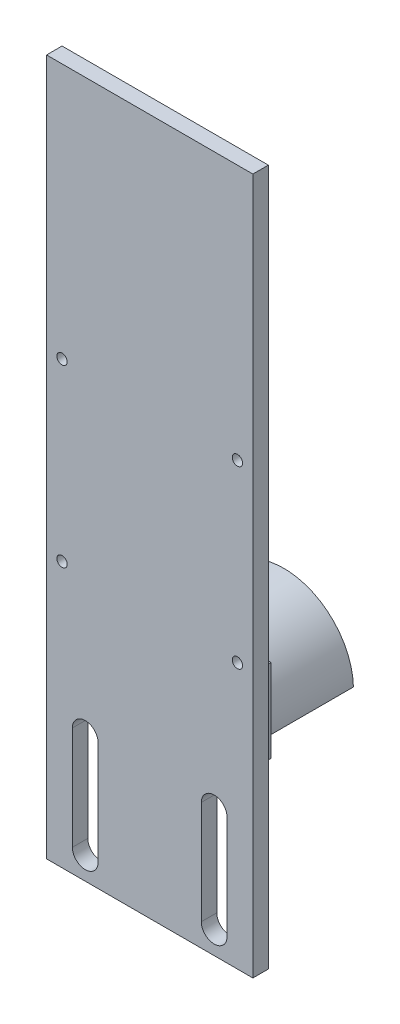
ISO-10303-21;
HEADER;
FILE_DESCRIPTION(('STEP AP214'),'2;1');
FILE_NAME('part.step','',(''),(''),'','','');
FILE_SCHEMA(('AUTOMOTIVE_DESIGN { 1 0 10303 214 1 1 1 1 }'));
ENDSEC;
DATA;
#1=APPLICATION_CONTEXT('core data for automotive mechanical design processes');
#2=APPLICATION_PROTOCOL_DEFINITION('international standard','automotive_design',2000,#1);
#3=PRODUCT_CONTEXT('',#1,'mechanical');
#4=PRODUCT('Part','Part','',(#3));
#5=PRODUCT_RELATED_PRODUCT_CATEGORY('part','',(#4));
#6=PRODUCT_DEFINITION_FORMATION('','',#4);
#7=PRODUCT_DEFINITION_CONTEXT('part definition',#1,'design');
#8=PRODUCT_DEFINITION('design','',#6,#7);
#9=PRODUCT_DEFINITION_SHAPE('','',#8);
#10=(LENGTH_UNIT() NAMED_UNIT(*) SI_UNIT(.MILLI.,.METRE.));
#11=(NAMED_UNIT(*) PLANE_ANGLE_UNIT() SI_UNIT($,.RADIAN.));
#12=(NAMED_UNIT(*) SI_UNIT($,.STERADIAN.) SOLID_ANGLE_UNIT());
#13=UNCERTAINTY_MEASURE_WITH_UNIT(LENGTH_MEASURE(1.E-05),#10,'distance_accuracy_value','');
#14=(GEOMETRIC_REPRESENTATION_CONTEXT(3) GLOBAL_UNCERTAINTY_ASSIGNED_CONTEXT((#13)) GLOBAL_UNIT_ASSIGNED_CONTEXT((#10,
#11,#12)) REPRESENTATION_CONTEXT('',''));
#15=CARTESIAN_POINT('',(0.,0.,0.));
#16=DIRECTION('',(0.,0.,1.));
#17=DIRECTION('',(1.,0.,0.));
#18=AXIS2_PLACEMENT_3D('',#15,#16,#17);
#19=CARTESIAN_POINT('',(0.,0.,0.));
#20=DIRECTION('',(0.,0.,-1.));
#21=DIRECTION('',(-1.,0.,0.));
#22=AXIS2_PLACEMENT_3D('',#19,#20,#21);
#23=PLANE('',#22);
#24=CARTESIAN_POINT('',(32.5,-10.5508711398169,0.));
#25=DIRECTION('',(0.,0.,-1.));
#26=DIRECTION('',(-1.,0.,0.));
#27=AXIS2_PLACEMENT_3D('',#24,#25,#26);
#28=CIRCLE('',#27,2.5);
#29=CARTESIAN_POINT('',(35.,-10.5508711398169,0.));
#30=VERTEX_POINT('',#29);
#31=CARTESIAN_POINT('',(30.,-10.5508711398169,0.));
#32=VERTEX_POINT('',#31);
#33=EDGE_CURVE('E467',#30,#32,#28,.T.);
#34=ORIENTED_EDGE('',*,*,#33,.F.);
#35=DIRECTION('',(0.,1.,0.));
#36=VECTOR('',#35,1.);
#37=CARTESIAN_POINT('',(35.,0.,0.));
#38=LINE('',#37,#36);
#39=CARTESIAN_POINT('',(35.,9.48176586604178,0.));
#40=VERTEX_POINT('',#39);
#41=EDGE_CURVE('E463',#30,#40,#38,.T.);
#42=ORIENTED_EDGE('',*,*,#41,.T.);
#43=CARTESIAN_POINT('',(32.5,9.48176586604178,0.));
#44=DIRECTION('',(0.,0.,-1.));
#45=DIRECTION('',(-1.,0.,0.));
#46=AXIS2_PLACEMENT_3D('',#43,#44,#45);
#47=CIRCLE('',#46,2.5);
#48=CARTESIAN_POINT('',(30.,9.48176586604178,0.));
#49=VERTEX_POINT('',#48);
#50=EDGE_CURVE('E460',#49,#40,#47,.T.);
#51=ORIENTED_EDGE('',*,*,#50,.F.);
#52=DIRECTION('',(0.,1.,0.));
#53=VECTOR('',#52,1.);
#54=CARTESIAN_POINT('',(30.,0.,0.));
#55=LINE('',#54,#53);
#56=EDGE_CURVE('E436',#32,#49,#55,.T.);
#57=ORIENTED_EDGE('',*,*,#56,.F.);
#58=EDGE_LOOP('',(#34,#42,#51,#57));
#59=FACE_BOUND('',#58,.T.);
#60=DIRECTION('',(-1.,0.,0.));
#61=VECTOR('',#60,1.);
#62=CARTESIAN_POINT('',(0.,120.,0.));
#63=LINE('',#62,#61);
#64=CARTESIAN_POINT('',(40.,120.,0.));
#65=VERTEX_POINT('',#64);
#66=CARTESIAN_POINT('',(0.,120.,0.));
#67=VERTEX_POINT('',#66);
#68=EDGE_CURVE('E411',#65,#67,#63,.T.);
#69=ORIENTED_EDGE('',*,*,#68,.F.);
#70=DIRECTION('',(0.,1.,0.));
#71=VECTOR('',#70,1.);
#72=CARTESIAN_POINT('',(40.,0.,0.));
#73=LINE('',#72,#71);
#74=CARTESIAN_POINT('',(40.,-15.,0.));
#75=VERTEX_POINT('',#74);
#76=EDGE_CURVE('E420',#75,#65,#73,.T.);
#77=ORIENTED_EDGE('',*,*,#76,.F.);
#78=DIRECTION('',(1.,0.,0.));
#79=VECTOR('',#78,1.);
#80=CARTESIAN_POINT('',(0.,-15.,0.));
#81=LINE('',#80,#79);
#82=CARTESIAN_POINT('',(0.,-15.,0.));
#83=VERTEX_POINT('',#82);
#84=EDGE_CURVE('E360',#83,#75,#81,.T.);
#85=ORIENTED_EDGE('',*,*,#84,.F.);
#86=DIRECTION('',(0.,-1.,0.));
#87=VECTOR('',#86,1.);
#88=CARTESIAN_POINT('',(0.,0.,0.));
#89=LINE('',#88,#87);
#90=EDGE_CURVE('E406',#67,#83,#89,.T.);
#91=ORIENTED_EDGE('',*,*,#90,.F.);
#92=EDGE_LOOP('',(#69,#77,#85,#91));
#93=FACE_BOUND('',#92,.T.);
#94=CARTESIAN_POINT('',(3.,70.4461491386061,0.));
#95=DIRECTION('',(0.,0.,-1.));
#96=DIRECTION('',(-1.,0.,0.));
#97=AXIS2_PLACEMENT_3D('',#94,#95,#96);
#98=CIRCLE('',#97,1.);
#99=CARTESIAN_POINT('',(2.,70.4461491386061,0.));
#100=VERTEX_POINT('',#99);
#101=EDGE_CURVE('E402',#100,#100,#98,.F.);
#102=ORIENTED_EDGE('',*,*,#101,.T.);
#103=EDGE_LOOP('',(#102));
#104=FACE_BOUND('',#103,.T.);
#105=CARTESIAN_POINT('',(37.,36.4461491386061,0.));
#106=DIRECTION('',(0.,0.,-1.));
#107=DIRECTION('',(-1.,0.,0.));
#108=AXIS2_PLACEMENT_3D('',#105,#106,#107);
#109=CIRCLE('',#108,0.999999999999998);
#110=CARTESIAN_POINT('',(36.,36.4461491386061,0.));
#111=VERTEX_POINT('',#110);
#112=EDGE_CURVE('E378',#111,#111,#109,.F.);
#113=ORIENTED_EDGE('',*,*,#112,.T.);
#114=EDGE_LOOP('',(#113));
#115=FACE_BOUND('',#114,.T.);
#116=CARTESIAN_POINT('',(37.,70.4461491386061,0.));
#117=DIRECTION('',(0.,0.,-1.));
#118=DIRECTION('',(-1.,0.,0.));
#119=AXIS2_PLACEMENT_3D('',#116,#117,#118);
#120=CIRCLE('',#119,0.999999999999998);
#121=CARTESIAN_POINT('',(36.,70.4461491386061,0.));
#122=VERTEX_POINT('',#121);
#123=EDGE_CURVE('E388',#122,#122,#120,.F.);
#124=ORIENTED_EDGE('',*,*,#123,.T.);
#125=EDGE_LOOP('',(#124));
#126=FACE_BOUND('',#125,.T.);
#127=CARTESIAN_POINT('',(3.,36.4461491386061,0.));
#128=DIRECTION('',(0.,0.,-1.));
#129=DIRECTION('',(-1.,0.,0.));
#130=AXIS2_PLACEMENT_3D('',#127,#128,#129);
#131=CIRCLE('',#130,1.);
#132=CARTESIAN_POINT('',(2.,36.4461491386061,0.));
#133=VERTEX_POINT('',#132);
#134=EDGE_CURVE('E387',#133,#133,#131,.F.);
#135=ORIENTED_EDGE('',*,*,#134,.T.);
#136=EDGE_LOOP('',(#135));
#137=FACE_BOUND('',#136,.T.);
#138=DIRECTION('',(0.,1.,0.));
#139=VECTOR('',#138,1.);
#140=CARTESIAN_POINT('',(5.,0.,0.));
#141=LINE('',#140,#139);
#142=CARTESIAN_POINT('',(5.,-10.5508711398169,0.));
#143=VERTEX_POINT('',#142);
#144=CARTESIAN_POINT('',(5.,9.48176586604178,0.));
#145=VERTEX_POINT('',#144);
#146=EDGE_CURVE('E471',#143,#145,#141,.T.);
#147=ORIENTED_EDGE('',*,*,#146,.F.);
#148=CARTESIAN_POINT('',(7.5,-10.5508711398169,0.));
#149=DIRECTION('',(0.,0.,-1.));
#150=DIRECTION('',(-1.,0.,0.));
#151=AXIS2_PLACEMENT_3D('',#148,#149,#150);
#152=CIRCLE('',#151,2.5);
#153=CARTESIAN_POINT('',(10.,-10.5508711398169,0.));
#154=VERTEX_POINT('',#153);
#155=EDGE_CURVE('E482',#143,#154,#152,.F.);
#156=ORIENTED_EDGE('',*,*,#155,.T.);
#157=DIRECTION('',(0.,1.,0.));
#158=VECTOR('',#157,1.);
#159=CARTESIAN_POINT('',(10.,0.,0.));
#160=LINE('',#159,#158);
#161=CARTESIAN_POINT('',(10.,9.48176586604178,0.));
#162=VERTEX_POINT('',#161);
#163=EDGE_CURVE('E478',#154,#162,#160,.T.);
#164=ORIENTED_EDGE('',*,*,#163,.T.);
#165=CARTESIAN_POINT('',(7.5,9.48176586604178,0.));
#166=DIRECTION('',(0.,0.,-1.));
#167=DIRECTION('',(-1.,0.,0.));
#168=AXIS2_PLACEMENT_3D('',#165,#166,#167);
#169=CIRCLE('',#168,2.5);
#170=EDGE_CURVE('E474',#162,#145,#169,.F.);
#171=ORIENTED_EDGE('',*,*,#170,.T.);
#172=EDGE_LOOP('',(#147,#156,#164,#171));
#173=FACE_BOUND('',#172,.T.);
#174=DIRECTION('',(0.,-1.,0.));
#175=VECTOR('',#174,1.);
#176=CARTESIAN_POINT('',(1.50351433339008,17.6115071637248,0.));
#177=LINE('',#176,#175);
#178=CARTESIAN_POINT('',(1.50351433339008,18.6115071637248,0.));
#179=VERTEX_POINT('',#178);
#180=CARTESIAN_POINT('',(1.50351433339008,17.6115071637248,0.));
#181=VERTEX_POINT('',#180);
#182=EDGE_CURVE('E503',#179,#181,#177,.T.);
#183=ORIENTED_EDGE('',*,*,#182,.T.);
#184=DIRECTION('',(-1.,0.,0.));
#185=VECTOR('',#184,1.);
#186=CARTESIAN_POINT('',(40.01,17.6115071637248,0.));
#187=LINE('',#186,#185);
#188=CARTESIAN_POINT('',(37.5,17.6115071637248,0.));
#189=VERTEX_POINT('',#188);
#190=EDGE_CURVE('E58',#189,#181,#187,.T.);
#191=ORIENTED_EDGE('',*,*,#190,.F.);
#192=DIRECTION('',(0.,-1.,0.));
#193=VECTOR('',#192,1.);
#194=CARTESIAN_POINT('',(37.5,0.,0.));
#195=LINE('',#194,#193);
#196=CARTESIAN_POINT('',(37.5,33.7478206035216,0.));
#197=VERTEX_POINT('',#196);
#198=EDGE_CURVE('E329',#197,#189,#195,.T.);
#199=ORIENTED_EDGE('',*,*,#198,.F.);
#200=DIRECTION('',(1.,0.,0.));
#201=VECTOR('',#200,1.);
#202=CARTESIAN_POINT('',(37.5,33.7478206035216,0.));
#203=LINE('',#202,#201);
#204=CARTESIAN_POINT('',(2.5,33.7478206035216,0.));
#205=VERTEX_POINT('',#204);
#206=EDGE_CURVE('E320',#205,#197,#203,.T.);
#207=ORIENTED_EDGE('',*,*,#206,.F.);
#208=DIRECTION('',(0.,1.,0.));
#209=VECTOR('',#208,1.);
#210=CARTESIAN_POINT('',(2.5,33.7478206035216,0.));
#211=LINE('',#210,#209);
#212=CARTESIAN_POINT('',(2.5,18.6115071637248,0.));
#213=VERTEX_POINT('',#212);
#214=EDGE_CURVE('E326',#213,#205,#211,.T.);
#215=ORIENTED_EDGE('',*,*,#214,.F.);
#216=DIRECTION('',(1.,0.,0.));
#217=VECTOR('',#216,1.);
#218=CARTESIAN_POINT('',(-1.6587633267783,18.6115071637248,0.));
#219=LINE('',#218,#217);
#220=EDGE_CURVE('E510',#179,#213,#219,.T.);
#221=ORIENTED_EDGE('',*,*,#220,.F.);
#222=EDGE_LOOP('',(#183,#191,#199,#207,#215,#221));
#223=FACE_BOUND('',#222,.T.);
#224=ADVANCED_FACE('F42',(#59,#93,#104,#115,#126,#137,#173,#223),#23,.T.);
#225=CARTESIAN_POINT('',(2.5,33.7478206035216,-51.6201130756344));
#226=DIRECTION('',(1.,0.,0.));
#227=DIRECTION('',(0.,1.,0.));
#228=AXIS2_PLACEMENT_3D('',#225,#226,#227);
#229=PLANE('',#228);
#230=DIRECTION('',(0.,0.,-1.));
#231=VECTOR('',#230,1.);
#232=CARTESIAN_POINT('',(2.5,18.6115071637248,0.));
#233=LINE('',#232,#231);
#234=CARTESIAN_POINT('',(2.5,18.6115071637248,-3.));
#235=VERTEX_POINT('',#234);
#236=EDGE_CURVE('E514',#213,#235,#233,.T.);
#237=ORIENTED_EDGE('',*,*,#236,.F.);
#238=ORIENTED_EDGE('',*,*,#214,.T.);
#239=DIRECTION('',(0.,0.,1.));
#240=VECTOR('',#239,1.);
#241=CARTESIAN_POINT('',(2.5,33.7478206035216,-51.6201130756344));
#242=LINE('',#241,#240);
#243=CARTESIAN_POINT('',(2.5,33.7478206035216,-3.));
#244=VERTEX_POINT('',#243);
#245=EDGE_CURVE('E325',#244,#205,#242,.T.);
#246=ORIENTED_EDGE('',*,*,#245,.F.);
#247=DIRECTION('',(0.,1.,0.));
#248=VECTOR('',#247,1.);
#249=CARTESIAN_POINT('',(2.5,33.7478206035216,-3.));
#250=LINE('',#249,#248);
#251=EDGE_CURVE('E333',#235,#244,#250,.T.);
#252=ORIENTED_EDGE('',*,*,#251,.F.);
#253=EDGE_LOOP('',(#237,#238,#246,#252));
#254=FACE_BOUND('',#253,.T.);
#255=ADVANCED_FACE('F542',(#254),#229,.F.);
#256=CARTESIAN_POINT('',(40.01,17.6115071637248,0.));
#257=DIRECTION('',(0.,1.,0.));
#258=DIRECTION('',(-1.,0.,0.));
#259=AXIS2_PLACEMENT_3D('',#256,#257,#258);
#260=PLANE('',#259);
#261=ORIENTED_EDGE('',*,*,#190,.T.);
#262=DIRECTION('',(0.,0.,-1.));
#263=VECTOR('',#262,1.);
#264=CARTESIAN_POINT('',(1.50351433339008,17.6115071637248,-3.));
#265=LINE('',#264,#263);
#266=CARTESIAN_POINT('',(1.50351433339008,17.6115071637248,-10.5211899829772));
#267=VERTEX_POINT('',#266);
#268=EDGE_CURVE('E250',#181,#267,#265,.T.);
#269=ORIENTED_EDGE('',*,*,#268,.T.);
#270=DIRECTION('',(-1.,0.,0.));
#271=VECTOR('',#270,1.);
#272=CARTESIAN_POINT('',(6.50351433339008,17.6115071637248,-10.5211899829772));
#273=LINE('',#272,#271);
#274=CARTESIAN_POINT('',(6.50351433339008,17.6115071637248,-10.5211899829772));
#275=VERTEX_POINT('',#274);
#276=EDGE_CURVE('E232',#275,#267,#273,.T.);
#277=ORIENTED_EDGE('',*,*,#276,.F.);
#278=DIRECTION('',(0.,0.,1.));
#279=VECTOR('',#278,1.);
#280=CARTESIAN_POINT('',(6.50351433339008,17.6115071637248,-15.5211899829772));
#281=LINE('',#280,#279);
#282=CARTESIAN_POINT('',(6.50351433339008,17.6115071637248,-15.5211899829772));
#283=VERTEX_POINT('',#282);
#284=EDGE_CURVE('E235',#283,#275,#281,.T.);
#285=ORIENTED_EDGE('',*,*,#284,.F.);
#286=DIRECTION('',(0.,0.,1.));
#287=VECTOR('',#286,1.);
#288=CARTESIAN_POINT('',(6.50351433339008,17.6115071637248,-23.));
#289=LINE('',#288,#287);
#290=CARTESIAN_POINT('',(6.50351433339008,17.6115071637248,-23.));
#291=VERTEX_POINT('',#290);
#292=EDGE_CURVE('E443',#291,#283,#289,.T.);
#293=ORIENTED_EDGE('',*,*,#292,.F.);
#294=DIRECTION('',(1.,0.,0.));
#295=VECTOR('',#294,1.);
#296=CARTESIAN_POINT('',(20.,17.6115071637248,-23.));
#297=LINE('',#296,#295);
#298=CARTESIAN_POINT('',(8.47254441911587,17.6115071637248,-23.));
#299=VERTEX_POINT('',#298);
#300=EDGE_CURVE('E442',#291,#299,#297,.T.);
#301=ORIENTED_EDGE('',*,*,#300,.T.);
#302=CARTESIAN_POINT('',(20.,17.6115071637248,-18.1758012914319));
#303=DIRECTION('',(0.,1.,0.));
#304=DIRECTION('',(-1.,0.,0.));
#305=AXIS2_PLACEMENT_3D('',#302,#303,#304);
#306=CIRCLE('',#305,12.4962044377086);
#307=CARTESIAN_POINT('',(31.5274555808841,17.6115071637248,-23.));
#308=VERTEX_POINT('',#307);
#309=EDGE_CURVE('E451',#308,#299,#306,.F.);
#310=ORIENTED_EDGE('',*,*,#309,.F.);
#311=CARTESIAN_POINT('',(33.4964856666099,17.6115071637248,-23.));
#312=VERTEX_POINT('',#311);
#313=EDGE_CURVE('E437',#308,#312,#297,.T.);
#314=ORIENTED_EDGE('',*,*,#313,.T.);
#315=DIRECTION('',(0.,0.,1.));
#316=VECTOR('',#315,1.);
#317=CARTESIAN_POINT('',(33.4964856666099,17.6115071637248,-23.));
#318=LINE('',#317,#316);
#319=CARTESIAN_POINT('',(33.4964856666099,17.6115071637248,-3.));
#320=VERTEX_POINT('',#319);
#321=EDGE_CURVE('E447',#320,#312,#318,.F.);
#322=ORIENTED_EDGE('',*,*,#321,.F.);
#323=DIRECTION('',(1.,0.,0.));
#324=VECTOR('',#323,1.);
#325=CARTESIAN_POINT('',(20.,17.6115071637248,-3.));
#326=LINE('',#325,#324);
#327=CARTESIAN_POINT('',(37.5,17.6115071637248,-3.));
#328=VERTEX_POINT('',#327);
#329=EDGE_CURVE('E438',#320,#328,#326,.T.);
#330=ORIENTED_EDGE('',*,*,#329,.T.);
#331=DIRECTION('',(0.,0.,-1.));
#332=VECTOR('',#331,1.);
#333=CARTESIAN_POINT('',(37.5,17.6115071637248,-51.6201130756344));
#334=LINE('',#333,#332);
#335=EDGE_CURVE('E373',#189,#328,#334,.T.);
#336=ORIENTED_EDGE('',*,*,#335,.F.);
#337=EDGE_LOOP('',(#261,#269,#277,#285,#293,#301,#310,#314,#322,#330,#336));
#338=FACE_BOUND('',#337,.T.);
#339=ADVANCED_FACE('F44',(#338),#260,.F.);
#340=CARTESIAN_POINT('',(20.,17.3034898736371,-3.));
#341=DIRECTION('',(0.,0.,-1.));
#342=DIRECTION('',(-1.,0.,0.));
#343=AXIS2_PLACEMENT_3D('',#340,#341,#342);
#344=PLANE('',#343);
#345=CARTESIAN_POINT('',(20.,17.3034898736371,-3.));
#346=DIRECTION('',(0.,0.,-1.));
#347=DIRECTION('',(-1.,0.,0.));
#348=AXIS2_PLACEMENT_3D('',#345,#346,#347);
#349=CIRCLE('',#348,13.5);
#350=CARTESIAN_POINT('',(6.5635164284389,18.6115071637248,-3.));
#351=VERTEX_POINT('',#350);
#352=EDGE_CURVE('E370',#351,#320,#349,.T.);
#353=ORIENTED_EDGE('',*,*,#352,.F.);
#354=DIRECTION('',(1.,0.,0.));
#355=VECTOR('',#354,1.);
#356=CARTESIAN_POINT('',(-11.0575444830397,18.6115071637248,-3.));
#357=LINE('',#356,#355);
#358=EDGE_CURVE('E242',#235,#351,#357,.T.);
#359=ORIENTED_EDGE('',*,*,#358,.F.);
#360=ORIENTED_EDGE('',*,*,#251,.T.);
#361=DIRECTION('',(1.,0.,0.));
#362=VECTOR('',#361,1.);
#363=CARTESIAN_POINT('',(37.5,33.7478206035216,-3.));
#364=LINE('',#363,#362);
#365=CARTESIAN_POINT('',(37.5,33.7478206035216,-3.));
#366=VERTEX_POINT('',#365);
#367=EDGE_CURVE('E324',#244,#366,#364,.T.);
#368=ORIENTED_EDGE('',*,*,#367,.T.);
#369=DIRECTION('',(0.,-1.,0.));
#370=VECTOR('',#369,1.);
#371=CARTESIAN_POINT('',(37.5,0.,-3.));
#372=LINE('',#371,#370);
#373=EDGE_CURVE('E337',#366,#328,#372,.T.);
#374=ORIENTED_EDGE('',*,*,#373,.T.);
#375=ORIENTED_EDGE('',*,*,#329,.F.);
#376=EDGE_LOOP('',(#353,#359,#360,#368,#374,#375));
#377=FACE_BOUND('',#376,.T.);
#378=ADVANCED_FACE('F662',(#377),#344,.T.);
#379=CARTESIAN_POINT('',(20.,17.3034898736371,-23.));
#380=DIRECTION('',(0.,0.,1.));
#381=DIRECTION('',(1.,0.,0.));
#382=AXIS2_PLACEMENT_3D('',#379,#380,#381);
#383=CYLINDRICAL_SURFACE('',#382,13.5);
#384=CARTESIAN_POINT('',(20.,17.3034898736371,-15.5211899829772));
#385=DIRECTION('',(0.,0.,1.));
#386=DIRECTION('',(1.,0.,0.));
#387=AXIS2_PLACEMENT_3D('',#384,#385,#386);
#388=CIRCLE('',#387,13.5);
#389=CARTESIAN_POINT('',(6.5635164284389,18.6115071637248,-15.5211899829772));
#390=VERTEX_POINT('',#389);
#391=EDGE_CURVE('E11',#390,#283,#388,.T.);
#392=ORIENTED_EDGE('',*,*,#391,.F.);
#393=DIRECTION('',(0.,0.,1.));
#394=VECTOR('',#393,1.);
#395=CARTESIAN_POINT('',(6.5635164284389,18.6115071637248,-23.));
#396=LINE('',#395,#394);
#397=EDGE_CURVE('E51',#351,#390,#396,.F.);
#398=ORIENTED_EDGE('',*,*,#397,.F.);
#399=ORIENTED_EDGE('',*,*,#352,.T.);
#400=ORIENTED_EDGE('',*,*,#321,.T.);
#401=CARTESIAN_POINT('',(20.,17.3034898736371,-23.));
#402=DIRECTION('',(0.,0.,-1.));
#403=DIRECTION('',(-1.,0.,0.));
#404=AXIS2_PLACEMENT_3D('',#401,#402,#403);
#405=CIRCLE('',#404,13.5);
#406=EDGE_CURVE('E365',#291,#312,#405,.T.);
#407=ORIENTED_EDGE('',*,*,#406,.F.);
#408=ORIENTED_EDGE('',*,*,#292,.T.);
#409=EDGE_LOOP('',(#392,#398,#399,#400,#407,#408));
#410=FACE_BOUND('',#409,.T.);
#411=ADVANCED_FACE('F590',(#410),#383,.T.);
#412=CARTESIAN_POINT('',(0.,0.,3.));
#413=DIRECTION('',(0.,0.,-1.));
#414=DIRECTION('',(-1.,0.,0.));
#415=AXIS2_PLACEMENT_3D('',#412,#413,#414);
#416=PLANE('',#415);
#417=DIRECTION('',(0.,-1.,0.));
#418=VECTOR('',#417,1.);
#419=CARTESIAN_POINT('',(0.,0.,3.));
#420=LINE('',#419,#418);
#421=CARTESIAN_POINT('',(0.,120.,3.));
#422=VERTEX_POINT('',#421);
#423=CARTESIAN_POINT('',(0.,-15.,3.));
#424=VERTEX_POINT('',#423);
#425=EDGE_CURVE('E407',#422,#424,#420,.T.);
#426=ORIENTED_EDGE('',*,*,#425,.T.);
#427=DIRECTION('',(-1.,0.,0.));
#428=VECTOR('',#427,1.);
#429=CARTESIAN_POINT('',(40.,-15.,3.));
#430=LINE('',#429,#428);
#431=CARTESIAN_POINT('',(40.,-15.,3.));
#432=VERTEX_POINT('',#431);
#433=EDGE_CURVE('E352',#432,#424,#430,.T.);
#434=ORIENTED_EDGE('',*,*,#433,.F.);
#435=DIRECTION('',(0.,1.,0.));
#436=VECTOR('',#435,1.);
#437=CARTESIAN_POINT('',(40.,0.,3.));
#438=LINE('',#437,#436);
#439=CARTESIAN_POINT('',(40.,120.,3.));
#440=VERTEX_POINT('',#439);
#441=EDGE_CURVE('E410',#432,#440,#438,.T.);
#442=ORIENTED_EDGE('',*,*,#441,.T.);
#443=DIRECTION('',(-1.,0.,0.));
#444=VECTOR('',#443,1.);
#445=CARTESIAN_POINT('',(0.,120.,3.));
#446=LINE('',#445,#444);
#447=EDGE_CURVE('E414',#440,#422,#446,.T.);
#448=ORIENTED_EDGE('',*,*,#447,.T.);
#449=EDGE_LOOP('',(#426,#434,#442,#448));
#450=FACE_BOUND('',#449,.T.);
#451=CARTESIAN_POINT('',(3.,70.4461491386061,3.));
#452=DIRECTION('',(0.,0.,1.));
#453=DIRECTION('',(1.,0.,0.));
#454=AXIS2_PLACEMENT_3D('',#451,#452,#453);
#455=CIRCLE('',#454,1.);
#456=CARTESIAN_POINT('',(4.,70.4461491386061,3.));
#457=VERTEX_POINT('',#456);
#458=EDGE_CURVE('E392',#457,#457,#455,.T.);
#459=ORIENTED_EDGE('',*,*,#458,.F.);
#460=EDGE_LOOP('',(#459));
#461=FACE_BOUND('',#460,.T.);
#462=CARTESIAN_POINT('',(37.,36.4461491386061,3.));
#463=DIRECTION('',(0.,0.,1.));
#464=DIRECTION('',(1.,0.,0.));
#465=AXIS2_PLACEMENT_3D('',#462,#463,#464);
#466=CIRCLE('',#465,0.999999999999998);
#467=CARTESIAN_POINT('',(38.,36.4461491386061,3.));
#468=VERTEX_POINT('',#467);
#469=EDGE_CURVE('E369',#468,#468,#466,.T.);
#470=ORIENTED_EDGE('',*,*,#469,.F.);
#471=EDGE_LOOP('',(#470));
#472=FACE_BOUND('',#471,.T.);
#473=CARTESIAN_POINT('',(37.,70.4461491386061,3.));
#474=DIRECTION('',(0.,0.,1.));
#475=DIRECTION('',(1.,0.,0.));
#476=AXIS2_PLACEMENT_3D('',#473,#474,#475);
#477=CIRCLE('',#476,0.999999999999998);
#478=CARTESIAN_POINT('',(38.,70.4461491386061,3.));
#479=VERTEX_POINT('',#478);
#480=EDGE_CURVE('E382',#479,#479,#477,.T.);
#481=ORIENTED_EDGE('',*,*,#480,.F.);
#482=EDGE_LOOP('',(#481));
#483=FACE_BOUND('',#482,.T.);
#484=CARTESIAN_POINT('',(3.,36.4461491386061,3.));
#485=DIRECTION('',(0.,0.,1.));
#486=DIRECTION('',(1.,0.,0.));
#487=AXIS2_PLACEMENT_3D('',#484,#485,#486);
#488=CIRCLE('',#487,1.);
#489=CARTESIAN_POINT('',(4.,36.4461491386061,3.));
#490=VERTEX_POINT('',#489);
#491=EDGE_CURVE('E383',#490,#490,#488,.T.);
#492=ORIENTED_EDGE('',*,*,#491,.F.);
#493=EDGE_LOOP('',(#492));
#494=FACE_BOUND('',#493,.T.);
#495=DIRECTION('',(0.,1.,0.));
#496=VECTOR('',#495,1.);
#497=CARTESIAN_POINT('',(35.,-10.5508711398169,3.));
#498=LINE('',#497,#496);
#499=CARTESIAN_POINT('',(35.,-10.5508711398169,3.));
#500=VERTEX_POINT('',#499);
#501=CARTESIAN_POINT('',(35.,9.48176586604178,3.));
#502=VERTEX_POINT('',#501);
#503=EDGE_CURVE('E301',#500,#502,#498,.T.);
#504=ORIENTED_EDGE('',*,*,#503,.F.);
#505=CARTESIAN_POINT('',(32.5,-10.5508711398169,3.));
#506=DIRECTION('',(0.,0.,-1.));
#507=DIRECTION('',(-1.,0.,0.));
#508=AXIS2_PLACEMENT_3D('',#505,#506,#507);
#509=CIRCLE('',#508,2.5);
#510=CARTESIAN_POINT('',(30.,-10.5508711398169,3.));
#511=VERTEX_POINT('',#510);
#512=EDGE_CURVE('E279',#500,#511,#509,.T.);
#513=ORIENTED_EDGE('',*,*,#512,.T.);
#514=DIRECTION('',(0.,1.,0.));
#515=VECTOR('',#514,1.);
#516=CARTESIAN_POINT('',(30.,-10.5508711398169,3.));
#517=LINE('',#516,#515);
#518=CARTESIAN_POINT('',(30.,9.48176586604178,3.));
#519=VERTEX_POINT('',#518);
#520=EDGE_CURVE('E293',#511,#519,#517,.T.);
#521=ORIENTED_EDGE('',*,*,#520,.T.);
#522=CARTESIAN_POINT('',(32.5,9.48176586604178,3.));
#523=DIRECTION('',(0.,0.,-1.));
#524=DIRECTION('',(-1.,0.,0.));
#525=AXIS2_PLACEMENT_3D('',#522,#523,#524);
#526=CIRCLE('',#525,2.5);
#527=EDGE_CURVE('E297',#519,#502,#526,.T.);
#528=ORIENTED_EDGE('',*,*,#527,.T.);
#529=EDGE_LOOP('',(#504,#513,#521,#528));
#530=FACE_BOUND('',#529,.T.);
#531=CARTESIAN_POINT('',(7.5,-10.5508711398169,3.));
#532=DIRECTION('',(0.,0.,1.));
#533=DIRECTION('',(1.,0.,0.));
#534=AXIS2_PLACEMENT_3D('',#531,#532,#533);
#535=CIRCLE('',#534,2.5);
#536=CARTESIAN_POINT('',(5.,-10.5508711398169,3.));
#537=VERTEX_POINT('',#536);
#538=CARTESIAN_POINT('',(10.,-10.5508711398169,3.));
#539=VERTEX_POINT('',#538);
#540=EDGE_CURVE('E253',#537,#539,#535,.T.);
#541=ORIENTED_EDGE('',*,*,#540,.F.);
#542=DIRECTION('',(0.,1.,0.));
#543=VECTOR('',#542,1.);
#544=CARTESIAN_POINT('',(5.,-10.5508711398169,3.));
#545=LINE('',#544,#543);
#546=CARTESIAN_POINT('',(5.,9.48176586604178,3.));
#547=VERTEX_POINT('',#546);
#548=EDGE_CURVE('E263',#537,#547,#545,.T.);
#549=ORIENTED_EDGE('',*,*,#548,.T.);
#550=CARTESIAN_POINT('',(7.5,9.48176586604178,3.));
#551=DIRECTION('',(0.,0.,1.));
#552=DIRECTION('',(1.,0.,0.));
#553=AXIS2_PLACEMENT_3D('',#550,#551,#552);
#554=CIRCLE('',#553,2.5);
#555=CARTESIAN_POINT('',(10.,9.48176586604178,3.));
#556=VERTEX_POINT('',#555);
#557=EDGE_CURVE('E267',#556,#547,#554,.T.);
#558=ORIENTED_EDGE('',*,*,#557,.F.);
#559=DIRECTION('',(0.,1.,0.));
#560=VECTOR('',#559,1.);
#561=CARTESIAN_POINT('',(10.,-10.5508711398169,3.));
#562=LINE('',#561,#560);
#563=EDGE_CURVE('E271',#539,#556,#562,.T.);
#564=ORIENTED_EDGE('',*,*,#563,.F.);
#565=EDGE_LOOP('',(#541,#549,#558,#564));
#566=FACE_BOUND('',#565,.T.);
#567=ADVANCED_FACE('F554',(#450,#461,#472,#483,#494,#530,#566),#416,.F.);
#568=CARTESIAN_POINT('',(0.,-15.,0.));
#569=DIRECTION('',(0.,-1.,0.));
#570=DIRECTION('',(0.,0.,-1.));
#571=AXIS2_PLACEMENT_3D('',#568,#569,#570);
#572=PLANE('',#571);
#573=DIRECTION('',(0.,0.,1.));
#574=VECTOR('',#573,1.);
#575=CARTESIAN_POINT('',(40.,-15.,0.));
#576=LINE('',#575,#574);
#577=EDGE_CURVE('E336',#75,#432,#576,.T.);
#578=ORIENTED_EDGE('',*,*,#577,.T.);
#579=ORIENTED_EDGE('',*,*,#433,.T.);
#580=DIRECTION('',(0.,0.,-1.));
#581=VECTOR('',#580,1.);
#582=CARTESIAN_POINT('',(0.,-15.,3.));
#583=LINE('',#582,#581);
#584=EDGE_CURVE('E356',#424,#83,#583,.T.);
#585=ORIENTED_EDGE('',*,*,#584,.T.);
#586=ORIENTED_EDGE('',*,*,#84,.T.);
#587=EDGE_LOOP('',(#578,#579,#585,#586));
#588=FACE_BOUND('',#587,.T.);
#589=ADVANCED_FACE('F581',(#588),#572,.T.);
#590=CARTESIAN_POINT('',(3.,36.4461491386061,-2.82842712474619));
#591=DIRECTION('',(0.,0.,1.));
#592=DIRECTION('',(1.,0.,0.));
#593=AXIS2_PLACEMENT_3D('',#590,#591,#592);
#594=CYLINDRICAL_SURFACE('',#593,1.);
#595=ORIENTED_EDGE('',*,*,#491,.T.);
#596=EDGE_LOOP('',(#595));
#597=FACE_BOUND('',#596,.T.);
#598=ORIENTED_EDGE('',*,*,#134,.F.);
#599=EDGE_LOOP('',(#598));
#600=FACE_BOUND('',#599,.T.);
#601=ADVANCED_FACE('F656',(#597,#600),#594,.F.);
#602=CARTESIAN_POINT('',(37.,70.4461491386061,-2.82842712474619));
#603=DIRECTION('',(0.,0.,1.));
#604=DIRECTION('',(1.,0.,0.));
#605=AXIS2_PLACEMENT_3D('',#602,#603,#604);
#606=CYLINDRICAL_SURFACE('',#605,0.999999999999998);
#607=ORIENTED_EDGE('',*,*,#480,.T.);
#608=EDGE_LOOP('',(#607));
#609=FACE_BOUND('',#608,.T.);
#610=ORIENTED_EDGE('',*,*,#123,.F.);
#611=EDGE_LOOP('',(#610));
#612=FACE_BOUND('',#611,.T.);
#613=ADVANCED_FACE('F669',(#609,#612),#606,.F.);
#614=CARTESIAN_POINT('',(37.,36.4461491386061,-2.82842712474619));
#615=DIRECTION('',(0.,0.,1.));
#616=DIRECTION('',(1.,0.,0.));
#617=AXIS2_PLACEMENT_3D('',#614,#615,#616);
#618=CYLINDRICAL_SURFACE('',#617,0.999999999999998);
#619=ORIENTED_EDGE('',*,*,#469,.T.);
#620=EDGE_LOOP('',(#619));
#621=FACE_BOUND('',#620,.T.);
#622=ORIENTED_EDGE('',*,*,#112,.F.);
#623=EDGE_LOOP('',(#622));
#624=FACE_BOUND('',#623,.T.);
#625=ADVANCED_FACE('F666',(#621,#624),#618,.F.);
#626=CARTESIAN_POINT('',(3.,70.4461491386061,-2.82842712474619));
#627=DIRECTION('',(0.,0.,1.));
#628=DIRECTION('',(1.,0.,0.));
#629=AXIS2_PLACEMENT_3D('',#626,#627,#628);
#630=CYLINDRICAL_SURFACE('',#629,1.);
#631=ORIENTED_EDGE('',*,*,#458,.T.);
#632=EDGE_LOOP('',(#631));
#633=FACE_BOUND('',#632,.T.);
#634=ORIENTED_EDGE('',*,*,#101,.F.);
#635=EDGE_LOOP('',(#634));
#636=FACE_BOUND('',#635,.T.);
#637=ADVANCED_FACE('F648',(#633,#636),#630,.F.);
#638=CARTESIAN_POINT('',(37.5,33.7478206035216,-51.6201130756344));
#639=DIRECTION('',(0.,-1.,0.));
#640=DIRECTION('',(0.,0.,-1.));
#641=AXIS2_PLACEMENT_3D('',#638,#639,#640);
#642=PLANE('',#641);
#643=ORIENTED_EDGE('',*,*,#367,.F.);
#644=ORIENTED_EDGE('',*,*,#245,.T.);
#645=ORIENTED_EDGE('',*,*,#206,.T.);
#646=DIRECTION('',(0.,0.,1.));
#647=VECTOR('',#646,1.);
#648=CARTESIAN_POINT('',(37.5,33.7478206035216,-51.6201130756344));
#649=LINE('',#648,#647);
#650=EDGE_CURVE('E309',#366,#197,#649,.T.);
#651=ORIENTED_EDGE('',*,*,#650,.F.);
#652=EDGE_LOOP('',(#643,#644,#645,#651));
#653=FACE_BOUND('',#652,.T.);
#654=ADVANCED_FACE('F646',(#653),#642,.F.);
#655=CARTESIAN_POINT('',(37.5,0.,-51.6201130756344));
#656=DIRECTION('',(-1.,0.,0.));
#657=DIRECTION('',(0.,0.,1.));
#658=AXIS2_PLACEMENT_3D('',#655,#656,#657);
#659=PLANE('',#658);
#660=ORIENTED_EDGE('',*,*,#198,.T.);
#661=ORIENTED_EDGE('',*,*,#335,.T.);
#662=ORIENTED_EDGE('',*,*,#373,.F.);
#663=ORIENTED_EDGE('',*,*,#650,.T.);
#664=EDGE_LOOP('',(#660,#661,#662,#663));
#665=FACE_BOUND('',#664,.T.);
#666=ADVANCED_FACE('F563',(#665),#659,.F.);
#667=CARTESIAN_POINT('',(40.,0.,3.));
#668=DIRECTION('',(-1.,0.,0.));
#669=DIRECTION('',(0.,0.,1.));
#670=AXIS2_PLACEMENT_3D('',#667,#668,#669);
#671=PLANE('',#670);
#672=ORIENTED_EDGE('',*,*,#76,.T.);
#673=DIRECTION('',(0.,0.,-1.));
#674=VECTOR('',#673,1.);
#675=CARTESIAN_POINT('',(40.,120.,3.));
#676=LINE('',#675,#674);
#677=EDGE_CURVE('E374',#440,#65,#676,.T.);
#678=ORIENTED_EDGE('',*,*,#677,.F.);
#679=ORIENTED_EDGE('',*,*,#441,.F.);
#680=ORIENTED_EDGE('',*,*,#577,.F.);
#681=EDGE_LOOP('',(#672,#678,#679,#680));
#682=FACE_BOUND('',#681,.T.);
#683=ADVANCED_FACE('F560',(#682),#671,.F.);
#684=CARTESIAN_POINT('',(0.,120.,3.));
#685=DIRECTION('',(0.,-1.,0.));
#686=DIRECTION('',(0.,0.,-1.));
#687=AXIS2_PLACEMENT_3D('',#684,#685,#686);
#688=PLANE('',#687);
#689=ORIENTED_EDGE('',*,*,#68,.T.);
#690=DIRECTION('',(0.,0.,-1.));
#691=VECTOR('',#690,1.);
#692=CARTESIAN_POINT('',(0.,120.,3.));
#693=LINE('',#692,#691);
#694=EDGE_CURVE('E417',#422,#67,#693,.T.);
#695=ORIENTED_EDGE('',*,*,#694,.F.);
#696=ORIENTED_EDGE('',*,*,#447,.F.);
#697=ORIENTED_EDGE('',*,*,#677,.T.);
#698=EDGE_LOOP('',(#689,#695,#696,#697));
#699=FACE_BOUND('',#698,.T.);
#700=ADVANCED_FACE('F556',(#699),#688,.F.);
#701=CARTESIAN_POINT('',(0.,0.,3.));
#702=DIRECTION('',(1.,0.,0.));
#703=DIRECTION('',(0.,0.,-1.));
#704=AXIS2_PLACEMENT_3D('',#701,#702,#703);
#705=PLANE('',#704);
#706=ORIENTED_EDGE('',*,*,#90,.T.);
#707=ORIENTED_EDGE('',*,*,#584,.F.);
#708=ORIENTED_EDGE('',*,*,#425,.F.);
#709=ORIENTED_EDGE('',*,*,#694,.T.);
#710=EDGE_LOOP('',(#706,#707,#708,#709));
#711=FACE_BOUND('',#710,.T.);
#712=ADVANCED_FACE('F559',(#711),#705,.F.);
#713=CARTESIAN_POINT('',(20.,17.3034898736371,-23.));
#714=DIRECTION('',(0.,0.,-1.));
#715=DIRECTION('',(-1.,0.,0.));
#716=AXIS2_PLACEMENT_3D('',#713,#714,#715);
#717=PLANE('',#716);
#718=ORIENTED_EDGE('',*,*,#300,.F.);
#719=ORIENTED_EDGE('',*,*,#406,.T.);
#720=ORIENTED_EDGE('',*,*,#313,.F.);
#721=CARTESIAN_POINT('',(20.,17.3034898736371,-23.));
#722=DIRECTION('',(0.,0.,-1.));
#723=DIRECTION('',(-1.,0.,0.));
#724=AXIS2_PLACEMENT_3D('',#721,#722,#723);
#725=CIRCLE('',#724,11.5315700067358);
#726=EDGE_CURVE('E364',#299,#308,#725,.T.);
#727=ORIENTED_EDGE('',*,*,#726,.F.);
#728=EDGE_LOOP('',(#718,#719,#720,#727));
#729=FACE_BOUND('',#728,.T.);
#730=ADVANCED_FACE('F566',(#729),#717,.T.);
#731=CARTESIAN_POINT('',(20.,17.3034898736371,-18.1758012914319));
#732=DIRECTION('',(0.,0.,-1.));
#733=DIRECTION('',(-1.,0.,0.));
#734=AXIS2_PLACEMENT_3D('',#731,#732,#733);
#735=SPHERICAL_SURFACE('',#734,12.5);
#736=ORIENTED_EDGE('',*,*,#726,.T.);
#737=ORIENTED_EDGE('',*,*,#309,.T.);
#738=EDGE_LOOP('',(#736,#737));
#739=FACE_BOUND('',#738,.T.);
#740=ADVANCED_FACE('F571',(#739),#735,.F.);
#741=CARTESIAN_POINT('',(32.5,-10.5508711398169,3.));
#742=DIRECTION('',(0.,0.,-1.));
#743=DIRECTION('',(-1.,0.,0.));
#744=AXIS2_PLACEMENT_3D('',#741,#742,#743);
#745=CYLINDRICAL_SURFACE('',#744,2.5);
#746=ORIENTED_EDGE('',*,*,#33,.T.);
#747=DIRECTION('',(0.,0.,-1.));
#748=VECTOR('',#747,1.);
#749=CARTESIAN_POINT('',(30.,-10.5508711398169,3.));
#750=LINE('',#749,#748);
#751=EDGE_CURVE('E304',#511,#32,#750,.T.);
#752=ORIENTED_EDGE('',*,*,#751,.F.);
#753=ORIENTED_EDGE('',*,*,#512,.F.);
#754=DIRECTION('',(0.,0.,-1.));
#755=VECTOR('',#754,1.);
#756=CARTESIAN_POINT('',(35.,-10.5508711398169,3.));
#757=LINE('',#756,#755);
#758=EDGE_CURVE('E305',#500,#30,#757,.T.);
#759=ORIENTED_EDGE('',*,*,#758,.T.);
#760=EDGE_LOOP('',(#746,#752,#753,#759));
#761=FACE_BOUND('',#760,.T.);
#762=ADVANCED_FACE('F635',(#761),#745,.F.);
#763=CARTESIAN_POINT('',(35.,-10.5508711398169,3.));
#764=DIRECTION('',(-1.,0.,0.));
#765=DIRECTION('',(0.,0.,1.));
#766=AXIS2_PLACEMENT_3D('',#763,#764,#765);
#767=PLANE('',#766);
#768=ORIENTED_EDGE('',*,*,#758,.F.);
#769=ORIENTED_EDGE('',*,*,#503,.T.);
#770=DIRECTION('',(0.,0.,-1.));
#771=VECTOR('',#770,1.);
#772=CARTESIAN_POINT('',(35.,9.48176586604178,3.));
#773=LINE('',#772,#771);
#774=EDGE_CURVE('E310',#502,#40,#773,.T.);
#775=ORIENTED_EDGE('',*,*,#774,.T.);
#776=ORIENTED_EDGE('',*,*,#41,.F.);
#777=EDGE_LOOP('',(#768,#769,#775,#776));
#778=FACE_BOUND('',#777,.T.);
#779=ADVANCED_FACE('F631',(#778),#767,.T.);
#780=CARTESIAN_POINT('',(32.5,9.48176586604178,3.));
#781=DIRECTION('',(0.,0.,-1.));
#782=DIRECTION('',(-1.,0.,0.));
#783=AXIS2_PLACEMENT_3D('',#780,#781,#782);
#784=CYLINDRICAL_SURFACE('',#783,2.5);
#785=ORIENTED_EDGE('',*,*,#50,.T.);
#786=ORIENTED_EDGE('',*,*,#774,.F.);
#787=ORIENTED_EDGE('',*,*,#527,.F.);
#788=DIRECTION('',(0.,0.,-1.));
#789=VECTOR('',#788,1.);
#790=CARTESIAN_POINT('',(30.,9.48176586604178,3.));
#791=LINE('',#790,#789);
#792=EDGE_CURVE('E314',#519,#49,#791,.T.);
#793=ORIENTED_EDGE('',*,*,#792,.T.);
#794=EDGE_LOOP('',(#785,#786,#787,#793));
#795=FACE_BOUND('',#794,.T.);
#796=ADVANCED_FACE('F634',(#795),#784,.F.);
#797=CARTESIAN_POINT('',(30.,-10.5508711398169,3.));
#798=DIRECTION('',(-1.,0.,0.));
#799=DIRECTION('',(0.,0.,1.));
#800=AXIS2_PLACEMENT_3D('',#797,#798,#799);
#801=PLANE('',#800);
#802=ORIENTED_EDGE('',*,*,#56,.T.);
#803=ORIENTED_EDGE('',*,*,#792,.F.);
#804=ORIENTED_EDGE('',*,*,#520,.F.);
#805=ORIENTED_EDGE('',*,*,#751,.T.);
#806=EDGE_LOOP('',(#802,#803,#804,#805));
#807=FACE_BOUND('',#806,.T.);
#808=ADVANCED_FACE('F630',(#807),#801,.F.);
#809=CARTESIAN_POINT('',(7.5,-10.5508711398169,3.));
#810=DIRECTION('',(0.,0.,-1.));
#811=DIRECTION('',(-1.,0.,0.));
#812=AXIS2_PLACEMENT_3D('',#809,#810,#811);
#813=CYLINDRICAL_SURFACE('',#812,2.5);
#814=DIRECTION('',(0.,0.,-1.));
#815=VECTOR('',#814,1.);
#816=CARTESIAN_POINT('',(5.,-10.5508711398169,3.));
#817=LINE('',#816,#815);
#818=EDGE_CURVE('E274',#537,#143,#817,.T.);
#819=ORIENTED_EDGE('',*,*,#818,.F.);
#820=ORIENTED_EDGE('',*,*,#540,.T.);
#821=DIRECTION('',(0.,0.,-1.));
#822=VECTOR('',#821,1.);
#823=CARTESIAN_POINT('',(10.,-10.5508711398169,3.));
#824=LINE('',#823,#822);
#825=EDGE_CURVE('E275',#539,#154,#824,.T.);
#826=ORIENTED_EDGE('',*,*,#825,.T.);
#827=ORIENTED_EDGE('',*,*,#155,.F.);
#828=EDGE_LOOP('',(#819,#820,#826,#827));
#829=FACE_BOUND('',#828,.T.);
#830=ADVANCED_FACE('F607',(#829),#813,.F.);
#831=CARTESIAN_POINT('',(10.,-10.5508711398169,3.));
#832=DIRECTION('',(-1.,0.,0.));
#833=DIRECTION('',(0.,0.,1.));
#834=AXIS2_PLACEMENT_3D('',#831,#832,#833);
#835=PLANE('',#834);
#836=ORIENTED_EDGE('',*,*,#825,.F.);
#837=ORIENTED_EDGE('',*,*,#563,.T.);
#838=DIRECTION('',(0.,0.,-1.));
#839=VECTOR('',#838,1.);
#840=CARTESIAN_POINT('',(10.,9.48176586604178,3.));
#841=LINE('',#840,#839);
#842=EDGE_CURVE('E280',#556,#162,#841,.T.);
#843=ORIENTED_EDGE('',*,*,#842,.T.);
#844=ORIENTED_EDGE('',*,*,#163,.F.);
#845=EDGE_LOOP('',(#836,#837,#843,#844));
#846=FACE_BOUND('',#845,.T.);
#847=ADVANCED_FACE('F610',(#846),#835,.T.);
#848=CARTESIAN_POINT('',(7.5,9.48176586604178,3.));
#849=DIRECTION('',(0.,0.,-1.));
#850=DIRECTION('',(-1.,0.,0.));
#851=AXIS2_PLACEMENT_3D('',#848,#849,#850);
#852=CYLINDRICAL_SURFACE('',#851,2.5);
#853=ORIENTED_EDGE('',*,*,#842,.F.);
#854=ORIENTED_EDGE('',*,*,#557,.T.);
#855=DIRECTION('',(0.,0.,-1.));
#856=VECTOR('',#855,1.);
#857=CARTESIAN_POINT('',(5.,9.48176586604178,3.));
#858=LINE('',#857,#856);
#859=EDGE_CURVE('E284',#547,#145,#858,.T.);
#860=ORIENTED_EDGE('',*,*,#859,.T.);
#861=ORIENTED_EDGE('',*,*,#170,.F.);
#862=EDGE_LOOP('',(#853,#854,#860,#861));
#863=FACE_BOUND('',#862,.T.);
#864=ADVANCED_FACE('F617',(#863),#852,.F.);
#865=CARTESIAN_POINT('',(5.,-10.5508711398169,3.));
#866=DIRECTION('',(-1.,0.,0.));
#867=DIRECTION('',(0.,0.,1.));
#868=AXIS2_PLACEMENT_3D('',#865,#866,#867);
#869=PLANE('',#868);
#870=ORIENTED_EDGE('',*,*,#146,.T.);
#871=ORIENTED_EDGE('',*,*,#859,.F.);
#872=ORIENTED_EDGE('',*,*,#548,.F.);
#873=ORIENTED_EDGE('',*,*,#818,.T.);
#874=EDGE_LOOP('',(#870,#871,#872,#873));
#875=FACE_BOUND('',#874,.T.);
#876=ADVANCED_FACE('F615',(#875),#869,.F.);
#877=CARTESIAN_POINT('',(-11.0575444830397,18.6115071637248,-15.5211899829772));
#878=DIRECTION('',(0.,-1.,0.));
#879=DIRECTION('',(1.,0.,0.));
#880=AXIS2_PLACEMENT_3D('',#877,#878,#879);
#881=PLANE('',#880);
#882=CARTESIAN_POINT('',(4.00351433339008,18.6115071637248,-13.0211899829772));
#883=DIRECTION('',(0.,-1.,0.));
#884=DIRECTION('',(1.,0.,0.));
#885=AXIS2_PLACEMENT_3D('',#882,#883,#884);
#886=CIRCLE('',#885,2.);
#887=CARTESIAN_POINT('',(6.00351433339008,18.6115071637248,-13.0211899829772));
#888=VERTEX_POINT('',#887);
#889=EDGE_CURVE('E519',#888,#888,#886,.F.);
#890=ORIENTED_EDGE('',*,*,#889,.F.);
#891=EDGE_LOOP('',(#890));
#892=FACE_BOUND('',#891,.T.);
#893=ORIENTED_EDGE('',*,*,#358,.T.);
#894=ORIENTED_EDGE('',*,*,#397,.T.);
#895=DIRECTION('',(1.,0.,0.));
#896=VECTOR('',#895,1.);
#897=CARTESIAN_POINT('',(-11.0575444830397,18.6115071637248,-15.5211899829772));
#898=LINE('',#897,#896);
#899=CARTESIAN_POINT('',(1.50351433339008,18.6115071637248,-15.5211899829772));
#900=VERTEX_POINT('',#899);
#901=EDGE_CURVE('E237',#900,#390,#898,.T.);
#902=ORIENTED_EDGE('',*,*,#901,.F.);
#903=DIRECTION('',(0.,0.,1.));
#904=VECTOR('',#903,1.);
#905=CARTESIAN_POINT('',(1.50351433339008,18.6115071637248,-15.5211899829772));
#906=LINE('',#905,#904);
#907=EDGE_CURVE('E66',#900,#179,#906,.T.);
#908=ORIENTED_EDGE('',*,*,#907,.T.);
#909=ORIENTED_EDGE('',*,*,#220,.T.);
#910=ORIENTED_EDGE('',*,*,#236,.T.);
#911=EDGE_LOOP('',(#893,#894,#902,#908,#909,#910));
#912=FACE_BOUND('',#911,.T.);
#913=ADVANCED_FACE('F487',(#892,#912),#881,.F.);
#914=CARTESIAN_POINT('',(-11.0575444830397,17.6115071637248,-15.5211899829772));
#915=DIRECTION('',(0.,0.,1.));
#916=DIRECTION('',(1.,0.,0.));
#917=AXIS2_PLACEMENT_3D('',#914,#915,#916);
#918=PLANE('',#917);
#919=ORIENTED_EDGE('',*,*,#901,.T.);
#920=ORIENTED_EDGE('',*,*,#391,.T.);
#921=DIRECTION('',(0.,1.,0.));
#922=VECTOR('',#921,1.);
#923=CARTESIAN_POINT('',(6.50351433339008,16.1115071637248,-15.5211899829772));
#924=LINE('',#923,#922);
#925=CARTESIAN_POINT('',(6.50351433339008,16.1115071637248,-15.5211899829772));
#926=VERTEX_POINT('',#925);
#927=EDGE_CURVE('E244',#926,#283,#924,.T.);
#928=ORIENTED_EDGE('',*,*,#927,.F.);
#929=DIRECTION('',(1.,0.,0.));
#930=VECTOR('',#929,1.);
#931=CARTESIAN_POINT('',(1.50351433339008,16.1115071637248,-15.5211899829772));
#932=LINE('',#931,#930);
#933=CARTESIAN_POINT('',(1.50351433339008,16.1115071637248,-15.5211899829772));
#934=VERTEX_POINT('',#933);
#935=EDGE_CURVE('E227',#934,#926,#932,.T.);
#936=ORIENTED_EDGE('',*,*,#935,.F.);
#937=DIRECTION('',(0.,1.,0.));
#938=VECTOR('',#937,1.);
#939=CARTESIAN_POINT('',(1.50351433339008,17.6115071637248,-15.5211899829772));
#940=LINE('',#939,#938);
#941=EDGE_CURVE('E251',#934,#900,#940,.T.);
#942=ORIENTED_EDGE('',*,*,#941,.T.);
#943=EDGE_LOOP('',(#919,#920,#928,#936,#942));
#944=FACE_BOUND('',#943,.T.);
#945=ADVANCED_FACE('F492',(#944),#918,.F.);
#946=CARTESIAN_POINT('',(1.50351433339008,16.1115071637248,-10.5211899829772));
#947=DIRECTION('',(1.,0.,0.));
#948=DIRECTION('',(0.,1.,0.));
#949=AXIS2_PLACEMENT_3D('',#946,#947,#948);
#950=PLANE('',#949);
#951=ORIENTED_EDGE('',*,*,#268,.F.);
#952=ORIENTED_EDGE('',*,*,#182,.F.);
#953=ORIENTED_EDGE('',*,*,#907,.F.);
#954=ORIENTED_EDGE('',*,*,#941,.F.);
#955=DIRECTION('',(0.,0.,-1.));
#956=VECTOR('',#955,1.);
#957=CARTESIAN_POINT('',(1.50351433339008,16.1115071637248,-10.5211899829772));
#958=LINE('',#957,#956);
#959=CARTESIAN_POINT('',(1.50351433339008,16.1115071637248,-10.5211899829772));
#960=VERTEX_POINT('',#959);
#961=EDGE_CURVE('E221',#960,#934,#958,.T.);
#962=ORIENTED_EDGE('',*,*,#961,.F.);
#963=DIRECTION('',(0.,1.,0.));
#964=VECTOR('',#963,1.);
#965=CARTESIAN_POINT('',(1.50351433339008,16.1115071637248,-10.5211899829772));
#966=LINE('',#965,#964);
#967=EDGE_CURVE('E216',#960,#267,#966,.T.);
#968=ORIENTED_EDGE('',*,*,#967,.T.);
#969=EDGE_LOOP('',(#951,#952,#953,#954,#962,#968));
#970=FACE_BOUND('',#969,.T.);
#971=ADVANCED_FACE('F494',(#970),#950,.F.);
#972=CARTESIAN_POINT('',(6.50351433339008,16.1115071637248,-15.5211899829772));
#973=DIRECTION('',(-1.,0.,0.));
#974=DIRECTION('',(0.,-1.,0.));
#975=AXIS2_PLACEMENT_3D('',#972,#973,#974);
#976=PLANE('',#975);
#977=ORIENTED_EDGE('',*,*,#284,.T.);
#978=DIRECTION('',(0.,1.,0.));
#979=VECTOR('',#978,1.);
#980=CARTESIAN_POINT('',(6.50351433339008,16.1115071637248,-10.5211899829772));
#981=LINE('',#980,#979);
#982=CARTESIAN_POINT('',(6.50351433339008,16.1115071637248,-10.5211899829772));
#983=VERTEX_POINT('',#982);
#984=EDGE_CURVE('E213',#983,#275,#981,.T.);
#985=ORIENTED_EDGE('',*,*,#984,.F.);
#986=DIRECTION('',(0.,0.,1.));
#987=VECTOR('',#986,1.);
#988=CARTESIAN_POINT('',(6.50351433339008,16.1115071637248,-15.5211899829772));
#989=LINE('',#988,#987);
#990=EDGE_CURVE('E222',#926,#983,#989,.T.);
#991=ORIENTED_EDGE('',*,*,#990,.F.);
#992=ORIENTED_EDGE('',*,*,#927,.T.);
#993=EDGE_LOOP('',(#977,#985,#991,#992));
#994=FACE_BOUND('',#993,.T.);
#995=ADVANCED_FACE('F234',(#994),#976,.F.);
#996=CARTESIAN_POINT('',(6.50351433339008,16.1115071637248,-10.5211899829772));
#997=DIRECTION('',(0.,0.,-1.));
#998=DIRECTION('',(-1.,0.,0.));
#999=AXIS2_PLACEMENT_3D('',#996,#997,#998);
#1000=PLANE('',#999);
#1001=ORIENTED_EDGE('',*,*,#276,.T.);
#1002=ORIENTED_EDGE('',*,*,#967,.F.);
#1003=DIRECTION('',(-1.,0.,0.));
#1004=VECTOR('',#1003,1.);
#1005=CARTESIAN_POINT('',(6.50351433339008,16.1115071637248,-10.5211899829772));
#1006=LINE('',#1005,#1004);
#1007=EDGE_CURVE('E208',#983,#960,#1006,.T.);
#1008=ORIENTED_EDGE('',*,*,#1007,.F.);
#1009=ORIENTED_EDGE('',*,*,#984,.T.);
#1010=EDGE_LOOP('',(#1001,#1002,#1008,#1009));
#1011=FACE_BOUND('',#1010,.T.);
#1012=ADVANCED_FACE('F211',(#1011),#1000,.F.);
#1013=CARTESIAN_POINT('',(0.,16.1115071637248,0.));
#1014=DIRECTION('',(0.,-1.,0.));
#1015=DIRECTION('',(0.,0.,-1.));
#1016=AXIS2_PLACEMENT_3D('',#1013,#1014,#1015);
#1017=PLANE('',#1016);
#1018=CARTESIAN_POINT('',(4.00351433339008,16.1115071637248,-13.0211899829772));
#1019=DIRECTION('',(0.,-1.,0.));
#1020=DIRECTION('',(0.,0.,-1.));
#1021=AXIS2_PLACEMENT_3D('',#1018,#1019,#1020);
#1022=CIRCLE('',#1021,2.);
#1023=CARTESIAN_POINT('',(4.00351433339008,16.1115071637248,-15.0211899829772));
#1024=VERTEX_POINT('',#1023);
#1025=EDGE_CURVE('E523',#1024,#1024,#1022,.T.);
#1026=ORIENTED_EDGE('',*,*,#1025,.F.);
#1027=EDGE_LOOP('',(#1026));
#1028=FACE_BOUND('',#1027,.T.);
#1029=ORIENTED_EDGE('',*,*,#990,.T.);
#1030=ORIENTED_EDGE('',*,*,#1007,.T.);
#1031=ORIENTED_EDGE('',*,*,#961,.T.);
#1032=ORIENTED_EDGE('',*,*,#935,.T.);
#1033=EDGE_LOOP('',(#1029,#1030,#1031,#1032));
#1034=FACE_BOUND('',#1033,.T.);
#1035=ADVANCED_FACE('F225',(#1028,#1034),#1017,.T.);
#1036=CARTESIAN_POINT('',(4.00351433339008,24.2683614132172,-13.0211899829772));
#1037=DIRECTION('',(0.,-1.,0.));
#1038=DIRECTION('',(0.,0.,-1.));
#1039=AXIS2_PLACEMENT_3D('',#1036,#1037,#1038);
#1040=CYLINDRICAL_SURFACE('',#1039,2.);
#1041=ORIENTED_EDGE('',*,*,#889,.T.);
#1042=EDGE_LOOP('',(#1041));
#1043=FACE_BOUND('',#1042,.T.);
#1044=ORIENTED_EDGE('',*,*,#1025,.T.);
#1045=EDGE_LOOP('',(#1044));
#1046=FACE_BOUND('',#1045,.T.);
#1047=ADVANCED_FACE('F528',(#1043,#1046),#1040,.F.);
#1048=CLOSED_SHELL('',(#224,#255,#339,#378,#411,#567,#589,#601,#613,#625,#637,#654,#666,#683,
#700,#712,#730,#740,#762,#779,#796,#808,#830,#847,#864,#876,#913,#945,#971,#995,#1012,#1035,#1047));
#1049=MANIFOLD_SOLID_BREP('B2',#1048);
#1050=ADVANCED_BREP_SHAPE_REPRESENTATION('',(#18,#1049),#14);
#1051=SHAPE_DEFINITION_REPRESENTATION(#9,#1050);
ENDSEC;
END-ISO-10303-21;
